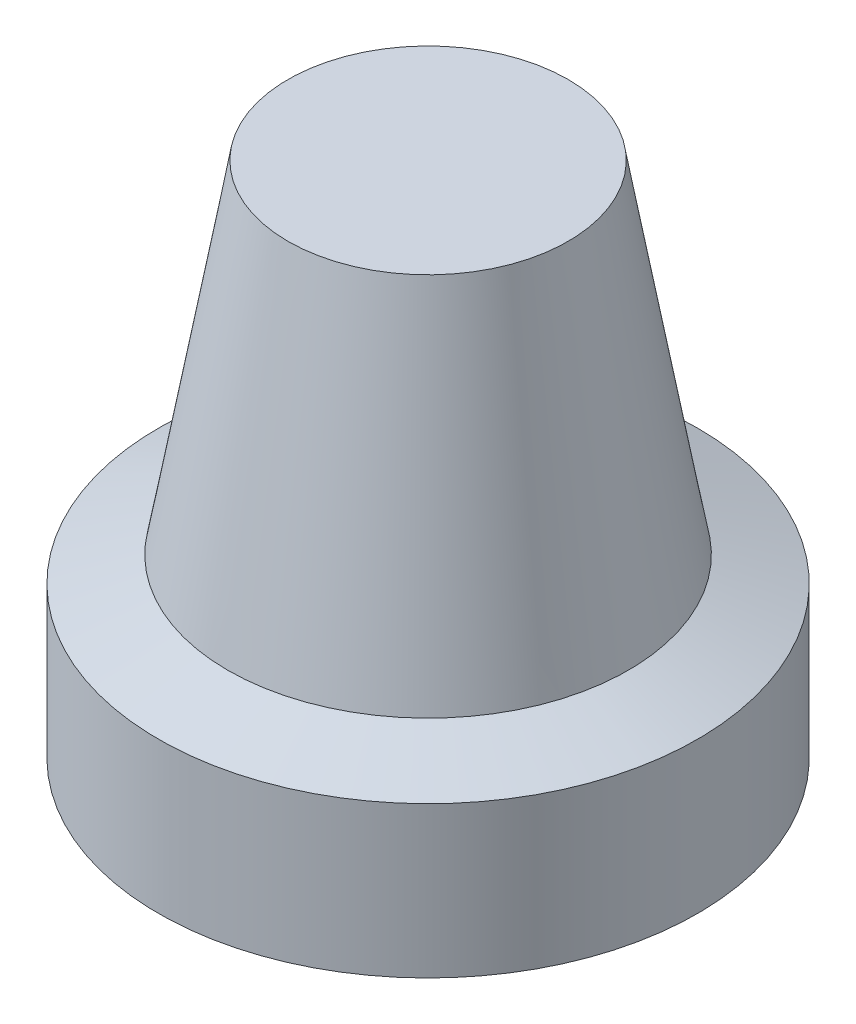
ISO-10303-21;
HEADER;
FILE_DESCRIPTION(('STEP AP214'),'2;1');
FILE_NAME('part.step','',(''),(''),'','','');
FILE_SCHEMA(('AUTOMOTIVE_DESIGN { 1 0 10303 214 1 1 1 1 }'));
ENDSEC;
DATA;
#1=APPLICATION_CONTEXT('core data for automotive mechanical design processes');
#2=APPLICATION_PROTOCOL_DEFINITION('international standard','automotive_design',2000,#1);
#3=PRODUCT_CONTEXT('',#1,'mechanical');
#4=PRODUCT('Part','Part','',(#3));
#5=PRODUCT_RELATED_PRODUCT_CATEGORY('part','',(#4));
#6=PRODUCT_DEFINITION_FORMATION('','',#4);
#7=PRODUCT_DEFINITION_CONTEXT('part definition',#1,'design');
#8=PRODUCT_DEFINITION('design','',#6,#7);
#9=PRODUCT_DEFINITION_SHAPE('','',#8);
#10=(LENGTH_UNIT() NAMED_UNIT(*) SI_UNIT(.MILLI.,.METRE.));
#11=(NAMED_UNIT(*) PLANE_ANGLE_UNIT() SI_UNIT($,.RADIAN.));
#12=(NAMED_UNIT(*) SI_UNIT($,.STERADIAN.) SOLID_ANGLE_UNIT());
#13=UNCERTAINTY_MEASURE_WITH_UNIT(LENGTH_MEASURE(1.E-05),#10,'distance_accuracy_value','');
#14=(GEOMETRIC_REPRESENTATION_CONTEXT(3) GLOBAL_UNCERTAINTY_ASSIGNED_CONTEXT((#13)) GLOBAL_UNIT_ASSIGNED_CONTEXT((#10,
#11,#12)) REPRESENTATION_CONTEXT('',''));
#15=CARTESIAN_POINT('',(0.,0.,0.));
#16=DIRECTION('',(0.,0.,1.));
#17=DIRECTION('',(1.,0.,0.));
#18=AXIS2_PLACEMENT_3D('',#15,#16,#17);
#19=CARTESIAN_POINT('',(0.,0.,0.));
#20=DIRECTION('',(0.,-1.,0.));
#21=DIRECTION('',(0.,0.,-1.));
#22=AXIS2_PLACEMENT_3D('',#19,#20,#21);
#23=PLANE('',#22);
#24=CARTESIAN_POINT('',(0.,0.,0.));
#25=DIRECTION('',(0.,-1.,0.));
#26=DIRECTION('',(0.,0.,-1.));
#27=AXIS2_PLACEMENT_3D('',#24,#25,#26);
#28=CIRCLE('',#27,3.);
#29=CARTESIAN_POINT('',(0.,0.,-3.));
#30=VERTEX_POINT('',#29);
#31=EDGE_CURVE('E68',#30,#30,#28,.T.);
#32=ORIENTED_EDGE('',*,*,#31,.F.);
#33=EDGE_LOOP('',(#32));
#34=FACE_BOUND('',#33,.T.);
#35=CARTESIAN_POINT('',(0.,0.,0.));
#36=DIRECTION('',(0.,-1.,0.));
#37=DIRECTION('',(0.,0.,-1.));
#38=AXIS2_PLACEMENT_3D('',#35,#36,#37);
#39=CIRCLE('',#38,5.);
#40=CARTESIAN_POINT('',(0.,0.,-5.));
#41=VERTEX_POINT('',#40);
#42=EDGE_CURVE('E10',#41,#41,#39,.T.);
#43=ORIENTED_EDGE('',*,*,#42,.T.);
#44=EDGE_LOOP('',(#43));
#45=FACE_BOUND('',#44,.T.);
#46=ADVANCED_FACE('F36',(#34,#45),#23,.T.);
#47=CARTESIAN_POINT('',(0.,0.,0.));
#48=DIRECTION('',(0.,-1.,0.));
#49=DIRECTION('',(0.,0.,-1.));
#50=AXIS2_PLACEMENT_3D('',#47,#48,#49);
#51=CONICAL_SURFACE('',#50,5.,1.22202532321099);
#52=CARTESIAN_POINT('',(0.,-2.,0.));
#53=DIRECTION('',(0.,-1.,0.));
#54=DIRECTION('',(0.,0.,-1.));
#55=AXIS2_PLACEMENT_3D('',#52,#53,#54);
#56=CIRCLE('',#55,10.5);
#57=CARTESIAN_POINT('',(0.,-2.,-10.5));
#58=VERTEX_POINT('',#57);
#59=EDGE_CURVE('E43',#58,#58,#56,.T.);
#60=ORIENTED_EDGE('',*,*,#59,.T.);
#61=EDGE_LOOP('',(#60));
#62=FACE_BOUND('',#61,.T.);
#63=ORIENTED_EDGE('',*,*,#42,.F.);
#64=EDGE_LOOP('',(#63));
#65=FACE_BOUND('',#64,.T.);
#66=ADVANCED_FACE('F86',(#62,#65),#51,.F.);
#67=CARTESIAN_POINT('',(10.5,-2.,0.));
#68=DIRECTION('',(0.,-1.,0.));
#69=DIRECTION('',(0.,0.,-1.));
#70=AXIS2_PLACEMENT_3D('',#67,#68,#69);
#71=PLANE('',#70);
#72=CARTESIAN_POINT('',(0.,-2.,0.));
#73=DIRECTION('',(0.,-1.,0.));
#74=DIRECTION('',(0.,0.,-1.));
#75=AXIS2_PLACEMENT_3D('',#72,#73,#74);
#76=CIRCLE('',#75,12.5);
#77=CARTESIAN_POINT('',(0.,-2.,-12.5));
#78=VERTEX_POINT('',#77);
#79=EDGE_CURVE('E48',#78,#78,#76,.T.);
#80=ORIENTED_EDGE('',*,*,#79,.T.);
#81=EDGE_LOOP('',(#80));
#82=FACE_BOUND('',#81,.T.);
#83=ORIENTED_EDGE('',*,*,#59,.F.);
#84=EDGE_LOOP('',(#83));
#85=FACE_BOUND('',#84,.T.);
#86=ADVANCED_FACE('F92',(#82,#85),#71,.T.);
#87=CARTESIAN_POINT('',(0.,-4.50196769355013,0.));
#88=DIRECTION('',(0.,-1.,0.));
#89=DIRECTION('',(0.,0.,-1.));
#90=AXIS2_PLACEMENT_3D('',#87,#88,#89);
#91=CYLINDRICAL_SURFACE('',#90,12.5);
#92=CARTESIAN_POINT('',(0.,5.,0.));
#93=DIRECTION('',(0.,-1.,0.));
#94=DIRECTION('',(0.,0.,-1.));
#95=AXIS2_PLACEMENT_3D('',#92,#93,#94);
#96=CIRCLE('',#95,12.5);
#97=CARTESIAN_POINT('',(0.,5.,-12.5));
#98=VERTEX_POINT('',#97);
#99=EDGE_CURVE('E53',#98,#98,#96,.T.);
#100=ORIENTED_EDGE('',*,*,#99,.T.);
#101=EDGE_LOOP('',(#100));
#102=FACE_BOUND('',#101,.T.);
#103=ORIENTED_EDGE('',*,*,#79,.F.);
#104=EDGE_LOOP('',(#103));
#105=FACE_BOUND('',#104,.T.);
#106=ADVANCED_FACE('F96',(#102,#105),#91,.T.);
#107=CARTESIAN_POINT('',(0.,5.,0.));
#108=DIRECTION('',(0.,-1.,0.));
#109=DIRECTION('',(0.,0.,-1.));
#110=AXIS2_PLACEMENT_3D('',#107,#108,#109);
#111=CONICAL_SURFACE('',#110,12.5,1.22173047639603);
#112=CARTESIAN_POINT('',(0.,6.16774237816294,0.));
#113=DIRECTION('',(0.,-1.,0.));
#114=DIRECTION('',(0.,0.,-1.));
#115=AXIS2_PLACEMENT_3D('',#112,#113,#114);
#116=CIRCLE('',#115,9.29165418425706);
#117=CARTESIAN_POINT('',(0.,6.16774237816294,-9.29165418425706));
#118=VERTEX_POINT('',#117);
#119=EDGE_CURVE('E59',#118,#118,#116,.T.);
#120=ORIENTED_EDGE('',*,*,#119,.T.);
#121=EDGE_LOOP('',(#120));
#122=FACE_BOUND('',#121,.T.);
#123=ORIENTED_EDGE('',*,*,#99,.F.);
#124=EDGE_LOOP('',(#123));
#125=FACE_BOUND('',#124,.T.);
#126=ADVANCED_FACE('F103',(#122,#125),#111,.T.);
#127=CARTESIAN_POINT('',(0.,6.16774237816294,0.));
#128=DIRECTION('',(0.,-1.,0.));
#129=DIRECTION('',(0.,0.,-1.));
#130=AXIS2_PLACEMENT_3D('',#127,#128,#129);
#131=CONICAL_SURFACE('',#130,9.29165418425706,0.17453292519943);
#132=CARTESIAN_POINT('',(0.,22.,0.));
#133=DIRECTION('',(0.,-1.,0.));
#134=DIRECTION('',(0.,0.,-1.));
#135=AXIS2_PLACEMENT_3D('',#132,#133,#134);
#136=CIRCLE('',#135,6.5);
#137=CARTESIAN_POINT('',(0.,22.,-6.5));
#138=VERTEX_POINT('',#137);
#139=EDGE_CURVE('E63',#138,#138,#136,.T.);
#140=ORIENTED_EDGE('',*,*,#139,.T.);
#141=EDGE_LOOP('',(#140));
#142=FACE_BOUND('',#141,.T.);
#143=ORIENTED_EDGE('',*,*,#119,.F.);
#144=EDGE_LOOP('',(#143));
#145=FACE_BOUND('',#144,.T.);
#146=ADVANCED_FACE('F107',(#142,#145),#131,.T.);
#147=CARTESIAN_POINT('',(6.5,22.,0.));
#148=DIRECTION('',(0.,1.,0.));
#149=DIRECTION('',(0.,0.,1.));
#150=AXIS2_PLACEMENT_3D('',#147,#148,#149);
#151=PLANE('',#150);
#152=ORIENTED_EDGE('',*,*,#139,.F.);
#153=EDGE_LOOP('',(#152));
#154=FACE_BOUND('',#153,.T.);
#155=ADVANCED_FACE('F81',(#154),#151,.T.);
#156=CARTESIAN_POINT('',(0.,10.,0.));
#157=DIRECTION('',(0.,-1.,0.));
#158=DIRECTION('',(0.,0.,-1.));
#159=AXIS2_PLACEMENT_3D('',#156,#157,#158);
#160=CYLINDRICAL_SURFACE('',#159,3.);
#161=CARTESIAN_POINT('',(0.,10.,0.));
#162=DIRECTION('',(0.,-1.,0.));
#163=DIRECTION('',(0.,0.,-1.));
#164=AXIS2_PLACEMENT_3D('',#161,#162,#163);
#165=CIRCLE('',#164,3.);
#166=CARTESIAN_POINT('',(0.,10.,-3.));
#167=VERTEX_POINT('',#166);
#168=EDGE_CURVE('E67',#167,#167,#165,.T.);
#169=ORIENTED_EDGE('',*,*,#168,.F.);
#170=EDGE_LOOP('',(#169));
#171=FACE_BOUND('',#170,.T.);
#172=ORIENTED_EDGE('',*,*,#31,.T.);
#173=EDGE_LOOP('',(#172));
#174=FACE_BOUND('',#173,.T.);
#175=ADVANCED_FACE('F78',(#171,#174),#160,.F.);
#176=CARTESIAN_POINT('',(0.,10.,0.));
#177=DIRECTION('',(0.,-1.,0.));
#178=DIRECTION('',(0.,0.,-1.));
#179=AXIS2_PLACEMENT_3D('',#176,#177,#178);
#180=PLANE('',#179);
#181=ORIENTED_EDGE('',*,*,#168,.T.);
#182=EDGE_LOOP('',(#181));
#183=FACE_BOUND('',#182,.T.);
#184=ADVANCED_FACE('F76',(#183),#180,.T.);
#185=CLOSED_SHELL('',(#46,#66,#86,#106,#126,#146,#155,#175,#184));
#186=MANIFOLD_SOLID_BREP('B2',#185);
#187=ADVANCED_BREP_SHAPE_REPRESENTATION('',(#18,#186),#14);
#188=SHAPE_DEFINITION_REPRESENTATION(#9,#187);
ENDSEC;
END-ISO-10303-21;
